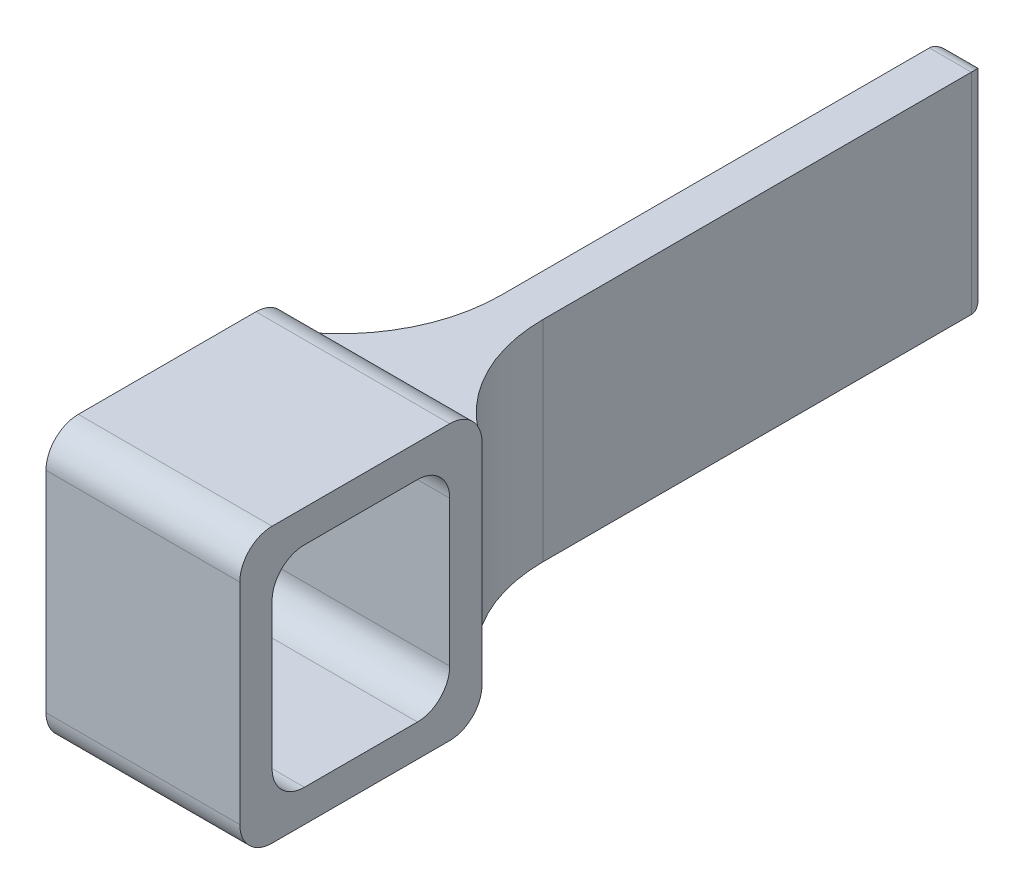
ISO-10303-21;
HEADER;
FILE_DESCRIPTION(('STEP AP214'),'2;1');
FILE_NAME('part.step','',(''),(''),'','','');
FILE_SCHEMA(('AUTOMOTIVE_DESIGN { 1 0 10303 214 1 1 1 1 }'));
ENDSEC;
DATA;
#1=APPLICATION_CONTEXT('core data for automotive mechanical design processes');
#2=APPLICATION_PROTOCOL_DEFINITION('international standard','automotive_design',2000,#1);
#3=PRODUCT_CONTEXT('',#1,'mechanical');
#4=PRODUCT('Part','Part','',(#3));
#5=PRODUCT_RELATED_PRODUCT_CATEGORY('part','',(#4));
#6=PRODUCT_DEFINITION_FORMATION('','',#4);
#7=PRODUCT_DEFINITION_CONTEXT('part definition',#1,'design');
#8=PRODUCT_DEFINITION('design','',#6,#7);
#9=PRODUCT_DEFINITION_SHAPE('','',#8);
#10=(LENGTH_UNIT() NAMED_UNIT(*) SI_UNIT(.MILLI.,.METRE.));
#11=(NAMED_UNIT(*) PLANE_ANGLE_UNIT() SI_UNIT($,.RADIAN.));
#12=(NAMED_UNIT(*) SI_UNIT($,.STERADIAN.) SOLID_ANGLE_UNIT());
#13=UNCERTAINTY_MEASURE_WITH_UNIT(LENGTH_MEASURE(1.E-05),#10,'distance_accuracy_value','');
#14=(GEOMETRIC_REPRESENTATION_CONTEXT(3) GLOBAL_UNCERTAINTY_ASSIGNED_CONTEXT((#13)) GLOBAL_UNIT_ASSIGNED_CONTEXT((#10,
#11,#12)) REPRESENTATION_CONTEXT('',''));
#15=CARTESIAN_POINT('',(0.,0.,0.));
#16=DIRECTION('',(0.,0.,1.));
#17=DIRECTION('',(1.,0.,0.));
#18=AXIS2_PLACEMENT_3D('',#15,#16,#17);
#19=CARTESIAN_POINT('',(-155.802837796785,45.9585336562613,-379.194639655427));
#20=DIRECTION('',(-1.,0.,0.));
#21=DIRECTION('',(0.,0.,1.));
#22=AXIS2_PLACEMENT_3D('',#19,#20,#21);
#23=CYLINDRICAL_SURFACE('',#22,0.999999999999973);
#24=CARTESIAN_POINT('',(-161.802837796785,45.9585336562613,-379.194639655427));
#25=DIRECTION('',(1.,0.,0.));
#26=DIRECTION('',(0.,0.,-1.));
#27=AXIS2_PLACEMENT_3D('',#24,#25,#26);
#28=CIRCLE('',#27,0.999999999999973);
#29=CARTESIAN_POINT('',(-161.802837796785,46.9585336562613,-379.194639655427));
#30=VERTEX_POINT('',#29);
#31=CARTESIAN_POINT('',(-161.802837796785,45.9585336562613,-378.194639655427));
#32=VERTEX_POINT('',#31);
#33=EDGE_CURVE('E254',#30,#32,#28,.T.);
#34=ORIENTED_EDGE('',*,*,#33,.T.);
#35=DIRECTION('',(-1.,0.,0.));
#36=VECTOR('',#35,1.);
#37=CARTESIAN_POINT('',(-155.802837796785,45.9585336562613,-378.194639655427));
#38=LINE('',#37,#36);
#39=CARTESIAN_POINT('',(-155.802837796785,45.9585336562613,-378.194639655427));
#40=VERTEX_POINT('',#39);
#41=EDGE_CURVE('E322',#40,#32,#38,.T.);
#42=ORIENTED_EDGE('',*,*,#41,.F.);
#43=CARTESIAN_POINT('',(-155.802837796785,45.9585336562613,-379.194639655427));
#44=DIRECTION('',(1.,0.,0.));
#45=DIRECTION('',(0.,0.,-1.));
#46=AXIS2_PLACEMENT_3D('',#43,#44,#45);
#47=CIRCLE('',#46,0.999999999999973);
#48=CARTESIAN_POINT('',(-155.802837796785,46.9585336562613,-379.194639655427));
#49=VERTEX_POINT('',#48);
#50=EDGE_CURVE('E266',#49,#40,#47,.T.);
#51=ORIENTED_EDGE('',*,*,#50,.F.);
#52=DIRECTION('',(-1.,0.,0.));
#53=VECTOR('',#52,1.);
#54=CARTESIAN_POINT('',(-155.802837796785,46.9585336562613,-379.194639655427));
#55=LINE('',#54,#53);
#56=EDGE_CURVE('E286',#49,#30,#55,.T.);
#57=ORIENTED_EDGE('',*,*,#56,.T.);
#58=EDGE_LOOP('',(#34,#42,#51,#57));
#59=FACE_BOUND('',#58,.T.);
#60=ADVANCED_FACE('F37',(#59),#23,.T.);
#61=CARTESIAN_POINT('',(-155.802837796785,45.9585336562613,-378.194639655427));
#62=DIRECTION('',(0.,0.,-1.));
#63=DIRECTION('',(-1.,0.,0.));
#64=AXIS2_PLACEMENT_3D('',#61,#62,#63);
#65=PLANE('',#64);
#66=DIRECTION('',(0.,-1.,0.));
#67=VECTOR('',#66,1.);
#68=CARTESIAN_POINT('',(-161.802837796785,45.9585336562613,-378.194639655427));
#69=LINE('',#68,#67);
#70=CARTESIAN_POINT('',(-161.802837796785,39.4585336562613,-378.194639655427));
#71=VERTEX_POINT('',#70);
#72=EDGE_CURVE('E289',#32,#71,#69,.T.);
#73=ORIENTED_EDGE('',*,*,#72,.T.);
#74=DIRECTION('',(-1.,0.,0.));
#75=VECTOR('',#74,1.);
#76=CARTESIAN_POINT('',(-155.802837796785,39.4585336562613,-378.194639655427));
#77=LINE('',#76,#75);
#78=CARTESIAN_POINT('',(-155.802837796785,39.4585336562613,-378.194639655427));
#79=VERTEX_POINT('',#78);
#80=EDGE_CURVE('E319',#79,#71,#77,.T.);
#81=ORIENTED_EDGE('',*,*,#80,.F.);
#82=DIRECTION('',(0.,-1.,0.));
#83=VECTOR('',#82,1.);
#84=CARTESIAN_POINT('',(-155.802837796785,45.9585336562613,-378.194639655427));
#85=LINE('',#84,#83);
#86=EDGE_CURVE('E269',#40,#79,#85,.T.);
#87=ORIENTED_EDGE('',*,*,#86,.F.);
#88=ORIENTED_EDGE('',*,*,#41,.T.);
#89=EDGE_LOOP('',(#73,#81,#87,#88));
#90=FACE_BOUND('',#89,.T.);
#91=ADVANCED_FACE('F399',(#90),#65,.F.);
#92=CARTESIAN_POINT('',(-155.802837796785,39.4585336562613,-379.194639655427));
#93=DIRECTION('',(-1.,0.,0.));
#94=DIRECTION('',(0.,0.,1.));
#95=AXIS2_PLACEMENT_3D('',#92,#93,#94);
#96=CYLINDRICAL_SURFACE('',#95,0.999999999999973);
#97=CARTESIAN_POINT('',(-161.802837796785,39.4585336562613,-379.194639655427));
#98=DIRECTION('',(1.,0.,0.));
#99=DIRECTION('',(0.,0.,1.));
#100=AXIS2_PLACEMENT_3D('',#97,#98,#99);
#101=CIRCLE('',#100,0.999999999999973);
#102=CARTESIAN_POINT('',(-161.802837796785,38.4585336562613,-379.194639655427));
#103=VERTEX_POINT('',#102);
#104=EDGE_CURVE('E291',#71,#103,#101,.T.);
#105=ORIENTED_EDGE('',*,*,#104,.T.);
#106=DIRECTION('',(-1.,0.,0.));
#107=VECTOR('',#106,1.);
#108=CARTESIAN_POINT('',(-155.802837796785,38.4585336562613,-379.194639655427));
#109=LINE('',#108,#107);
#110=CARTESIAN_POINT('',(-155.802837796785,38.4585336562613,-379.194639655427));
#111=VERTEX_POINT('',#110);
#112=EDGE_CURVE('E316',#111,#103,#109,.T.);
#113=ORIENTED_EDGE('',*,*,#112,.F.);
#114=CARTESIAN_POINT('',(-155.802837796785,39.4585336562613,-379.194639655427));
#115=DIRECTION('',(1.,0.,0.));
#116=DIRECTION('',(0.,0.,1.));
#117=AXIS2_PLACEMENT_3D('',#114,#115,#116);
#118=CIRCLE('',#117,0.999999999999973);
#119=EDGE_CURVE('E272',#79,#111,#118,.T.);
#120=ORIENTED_EDGE('',*,*,#119,.F.);
#121=ORIENTED_EDGE('',*,*,#80,.T.);
#122=EDGE_LOOP('',(#105,#113,#120,#121));
#123=FACE_BOUND('',#122,.T.);
#124=ADVANCED_FACE('F405',(#123),#96,.T.);
#125=CARTESIAN_POINT('',(-155.802837796785,38.4585336562613,-384.694639655427));
#126=DIRECTION('',(0.,1.,0.));
#127=DIRECTION('',(-1.,0.,0.));
#128=AXIS2_PLACEMENT_3D('',#125,#126,#127);
#129=PLANE('',#128);
#130=DIRECTION('',(0.,0.,-1.));
#131=VECTOR('',#130,1.);
#132=CARTESIAN_POINT('',(-161.802837796785,38.4585336562613,-384.694639655427));
#133=LINE('',#132,#131);
#134=CARTESIAN_POINT('',(-161.802837796785,38.4585336562613,-384.694639655427));
#135=VERTEX_POINT('',#134);
#136=EDGE_CURVE('E293',#103,#135,#133,.T.);
#137=ORIENTED_EDGE('',*,*,#136,.T.);
#138=DIRECTION('',(-1.,0.,0.));
#139=VECTOR('',#138,1.);
#140=CARTESIAN_POINT('',(-155.802837796785,38.4585336562613,-384.694639655427));
#141=LINE('',#140,#139);
#142=CARTESIAN_POINT('',(-155.802837796785,38.4585336562613,-384.694639655427));
#143=VERTEX_POINT('',#142);
#144=EDGE_CURVE('E313',#143,#135,#141,.T.);
#145=ORIENTED_EDGE('',*,*,#144,.F.);
#146=DIRECTION('',(0.,0.,-1.));
#147=VECTOR('',#146,1.);
#148=CARTESIAN_POINT('',(-155.802837796785,38.4585336562613,-384.694639655427));
#149=LINE('',#148,#147);
#150=EDGE_CURVE('E274',#111,#143,#149,.T.);
#151=ORIENTED_EDGE('',*,*,#150,.F.);
#152=ORIENTED_EDGE('',*,*,#112,.T.);
#153=EDGE_LOOP('',(#137,#145,#151,#152));
#154=FACE_BOUND('',#153,.T.);
#155=ADVANCED_FACE('F609',(#154),#129,.F.);
#156=CARTESIAN_POINT('',(-155.802837796785,39.4585336562613,-384.694639655427));
#157=DIRECTION('',(-1.,0.,0.));
#158=DIRECTION('',(0.,0.,1.));
#159=AXIS2_PLACEMENT_3D('',#156,#157,#158);
#160=CYLINDRICAL_SURFACE('',#159,0.999999999999973);
#161=CARTESIAN_POINT('',(-161.802837796785,39.4585336562613,-384.694639655427));
#162=DIRECTION('',(1.,0.,0.));
#163=DIRECTION('',(0.,0.,1.));
#164=AXIS2_PLACEMENT_3D('',#161,#162,#163);
#165=CIRCLE('',#164,0.999999999999973);
#166=CARTESIAN_POINT('',(-161.802837796785,39.4585336562613,-385.694639655427));
#167=VERTEX_POINT('',#166);
#168=EDGE_CURVE('E295',#135,#167,#165,.T.);
#169=ORIENTED_EDGE('',*,*,#168,.T.);
#170=DIRECTION('',(-1.,0.,0.));
#171=VECTOR('',#170,1.);
#172=CARTESIAN_POINT('',(-155.802837796785,39.4585336562613,-385.694639655427));
#173=LINE('',#172,#171);
#174=CARTESIAN_POINT('',(-155.802837796785,39.4585336562613,-385.694639655427));
#175=VERTEX_POINT('',#174);
#176=EDGE_CURVE('E311',#175,#167,#173,.T.);
#177=ORIENTED_EDGE('',*,*,#176,.F.);
#178=CARTESIAN_POINT('',(-155.802837796785,39.4585336562613,-384.694639655427));
#179=DIRECTION('',(1.,0.,0.));
#180=DIRECTION('',(0.,0.,1.));
#181=AXIS2_PLACEMENT_3D('',#178,#179,#180);
#182=CIRCLE('',#181,0.999999999999973);
#183=EDGE_CURVE('E276',#143,#175,#182,.T.);
#184=ORIENTED_EDGE('',*,*,#183,.F.);
#185=ORIENTED_EDGE('',*,*,#144,.T.);
#186=EDGE_LOOP('',(#169,#177,#184,#185));
#187=FACE_BOUND('',#186,.T.);
#188=ADVANCED_FACE('F442',(#187),#160,.T.);
#189=CARTESIAN_POINT('',(-155.802837796785,45.9585336562613,-384.694639655427));
#190=DIRECTION('',(-1.,0.,0.));
#191=DIRECTION('',(0.,0.,1.));
#192=AXIS2_PLACEMENT_3D('',#189,#190,#191);
#193=CYLINDRICAL_SURFACE('',#192,0.999999999999973);
#194=CARTESIAN_POINT('',(-161.802837796785,45.9585336562613,-384.694639655427));
#195=DIRECTION('',(1.,0.,0.));
#196=DIRECTION('',(0.,0.,1.));
#197=AXIS2_PLACEMENT_3D('',#194,#195,#196);
#198=CIRCLE('',#197,0.999999999999973);
#199=CARTESIAN_POINT('',(-161.802837796785,45.9585336562613,-385.694639655427));
#200=VERTEX_POINT('',#199);
#201=CARTESIAN_POINT('',(-161.802837796785,46.9585336562613,-384.694639655427));
#202=VERTEX_POINT('',#201);
#203=EDGE_CURVE('E301',#200,#202,#198,.T.);
#204=ORIENTED_EDGE('',*,*,#203,.T.);
#205=DIRECTION('',(-1.,0.,0.));
#206=VECTOR('',#205,1.);
#207=CARTESIAN_POINT('',(-155.802837796785,46.9585336562613,-384.694639655427));
#208=LINE('',#207,#206);
#209=CARTESIAN_POINT('',(-155.802837796785,46.9585336562613,-384.694639655427));
#210=VERTEX_POINT('',#209);
#211=EDGE_CURVE('E306',#210,#202,#208,.T.);
#212=ORIENTED_EDGE('',*,*,#211,.F.);
#213=CARTESIAN_POINT('',(-155.802837796785,45.9585336562613,-384.694639655427));
#214=DIRECTION('',(1.,0.,0.));
#215=DIRECTION('',(0.,0.,1.));
#216=AXIS2_PLACEMENT_3D('',#213,#214,#215);
#217=CIRCLE('',#216,0.999999999999973);
#218=CARTESIAN_POINT('',(-155.802837796785,45.9585336562613,-385.694639655427));
#219=VERTEX_POINT('',#218);
#220=EDGE_CURVE('E282',#219,#210,#217,.T.);
#221=ORIENTED_EDGE('',*,*,#220,.F.);
#222=DIRECTION('',(-1.,0.,0.));
#223=VECTOR('',#222,1.);
#224=CARTESIAN_POINT('',(-155.802837796785,45.9585336562613,-385.694639655427));
#225=LINE('',#224,#223);
#226=EDGE_CURVE('E309',#219,#200,#225,.T.);
#227=ORIENTED_EDGE('',*,*,#226,.T.);
#228=EDGE_LOOP('',(#204,#212,#221,#227));
#229=FACE_BOUND('',#228,.T.);
#230=ADVANCED_FACE('F449',(#229),#193,.T.);
#231=CARTESIAN_POINT('',(-155.802837796785,46.9585336562613,-384.694639655427));
#232=DIRECTION('',(0.,-1.,0.));
#233=DIRECTION('',(1.,0.,0.));
#234=AXIS2_PLACEMENT_3D('',#231,#232,#233);
#235=PLANE('',#234);
#236=DIRECTION('',(0.,0.,1.));
#237=VECTOR('',#236,1.);
#238=CARTESIAN_POINT('',(-161.802837796785,46.9585336562613,-384.694639655427));
#239=LINE('',#238,#237);
#240=EDGE_CURVE('E270',#202,#30,#239,.T.);
#241=ORIENTED_EDGE('',*,*,#240,.T.);
#242=ORIENTED_EDGE('',*,*,#56,.F.);
#243=DIRECTION('',(0.,0.,1.));
#244=VECTOR('',#243,1.);
#245=CARTESIAN_POINT('',(-155.802837796785,46.9585336562613,-384.694639655427));
#246=LINE('',#245,#244);
#247=EDGE_CURVE('E284',#210,#49,#246,.T.);
#248=ORIENTED_EDGE('',*,*,#247,.F.);
#249=ORIENTED_EDGE('',*,*,#211,.T.);
#250=EDGE_LOOP('',(#241,#242,#248,#249));
#251=FACE_BOUND('',#250,.T.);
#252=ADVANCED_FACE('F453',(#251),#235,.F.);
#253=CARTESIAN_POINT('',(-155.802837796785,45.9585336562613,-379.194639655427));
#254=DIRECTION('',(1.,0.,0.));
#255=DIRECTION('',(0.,0.,-1.));
#256=AXIS2_PLACEMENT_3D('',#253,#254,#255);
#257=PLANE('',#256);
#258=CARTESIAN_POINT('',(-155.802837796785,40.4585336562613,-383.694639655427));
#259=DIRECTION('',(1.,0.,0.));
#260=DIRECTION('',(0.,0.,-1.));
#261=AXIS2_PLACEMENT_3D('',#258,#259,#260);
#262=CIRCLE('',#261,0.99999999999997);
#263=CARTESIAN_POINT('',(-155.802837796785,39.4585336562613,-383.694639655427));
#264=VERTEX_POINT('',#263);
#265=CARTESIAN_POINT('',(-155.802837796785,40.4585336562613,-384.694639655427));
#266=VERTEX_POINT('',#265);
#267=EDGE_CURVE('E194',#264,#266,#262,.T.);
#268=ORIENTED_EDGE('',*,*,#267,.F.);
#269=DIRECTION('',(0.,0.,-1.));
#270=VECTOR('',#269,1.);
#271=CARTESIAN_POINT('',(-155.802837796785,39.4585336562613,-380.194639655427));
#272=LINE('',#271,#270);
#273=CARTESIAN_POINT('',(-155.802837796785,39.4585336562613,-380.194639655427));
#274=VERTEX_POINT('',#273);
#275=EDGE_CURVE('E213',#274,#264,#272,.T.);
#276=ORIENTED_EDGE('',*,*,#275,.F.);
#277=CARTESIAN_POINT('',(-155.802837796785,40.4585336562613,-380.194639655427));
#278=DIRECTION('',(1.,0.,0.));
#279=DIRECTION('',(0.,0.,-1.));
#280=AXIS2_PLACEMENT_3D('',#277,#278,#279);
#281=CIRCLE('',#280,0.99999999999997);
#282=CARTESIAN_POINT('',(-155.802837796785,40.4585336562613,-379.194639655427));
#283=VERTEX_POINT('',#282);
#284=EDGE_CURVE('E216',#283,#274,#281,.T.);
#285=ORIENTED_EDGE('',*,*,#284,.F.);
#286=DIRECTION('',(0.,-1.,0.));
#287=VECTOR('',#286,1.);
#288=CARTESIAN_POINT('',(-155.802837796785,44.9585336562613,-379.194639655427));
#289=LINE('',#288,#287);
#290=CARTESIAN_POINT('',(-155.802837796785,44.9585336562613,-379.194639655427));
#291=VERTEX_POINT('',#290);
#292=EDGE_CURVE('E247',#291,#283,#289,.T.);
#293=ORIENTED_EDGE('',*,*,#292,.F.);
#294=CARTESIAN_POINT('',(-155.802837796785,44.9585336562613,-380.194639655427));
#295=DIRECTION('',(1.,0.,0.));
#296=DIRECTION('',(0.,0.,-1.));
#297=AXIS2_PLACEMENT_3D('',#294,#295,#296);
#298=CIRCLE('',#297,0.99999999999997);
#299=CARTESIAN_POINT('',(-155.802837796785,45.9585336562612,-380.194639655427));
#300=VERTEX_POINT('',#299);
#301=EDGE_CURVE('E244',#300,#291,#298,.T.);
#302=ORIENTED_EDGE('',*,*,#301,.F.);
#303=DIRECTION('',(0.,0.,1.));
#304=VECTOR('',#303,1.);
#305=CARTESIAN_POINT('',(-155.802837796785,45.9585336562613,-380.194639655427));
#306=LINE('',#305,#304);
#307=CARTESIAN_POINT('',(-155.802837796785,45.9585336562613,-383.694639655427));
#308=VERTEX_POINT('',#307);
#309=EDGE_CURVE('E241',#308,#300,#306,.T.);
#310=ORIENTED_EDGE('',*,*,#309,.F.);
#311=CARTESIAN_POINT('',(-155.802837796785,44.9585336562613,-383.694639655427));
#312=DIRECTION('',(1.,0.,0.));
#313=DIRECTION('',(0.,0.,1.));
#314=AXIS2_PLACEMENT_3D('',#311,#312,#313);
#315=CIRCLE('',#314,0.99999999999997);
#316=CARTESIAN_POINT('',(-155.802837796785,44.9585336562613,-384.694639655427));
#317=VERTEX_POINT('',#316);
#318=EDGE_CURVE('E238',#317,#308,#315,.T.);
#319=ORIENTED_EDGE('',*,*,#318,.F.);
#320=DIRECTION('',(0.,1.,0.));
#321=VECTOR('',#320,1.);
#322=CARTESIAN_POINT('',(-155.802837796785,44.9585336562613,-384.694639655427));
#323=LINE('',#322,#321);
#324=EDGE_CURVE('E236',#266,#317,#323,.T.);
#325=ORIENTED_EDGE('',*,*,#324,.F.);
#326=EDGE_LOOP('',(#268,#276,#285,#293,#302,#310,#319,#325));
#327=FACE_BOUND('',#326,.T.);
#328=ORIENTED_EDGE('',*,*,#50,.T.);
#329=ORIENTED_EDGE('',*,*,#86,.T.);
#330=ORIENTED_EDGE('',*,*,#119,.T.);
#331=ORIENTED_EDGE('',*,*,#150,.T.);
#332=ORIENTED_EDGE('',*,*,#183,.T.);
#333=DIRECTION('',(0.,1.,0.));
#334=VECTOR('',#333,1.);
#335=CARTESIAN_POINT('',(-155.802837796785,45.9585336562613,-385.694639655427));
#336=LINE('',#335,#334);
#337=EDGE_CURVE('E279',#175,#219,#336,.T.);
#338=ORIENTED_EDGE('',*,*,#337,.T.);
#339=ORIENTED_EDGE('',*,*,#220,.T.);
#340=ORIENTED_EDGE('',*,*,#247,.T.);
#341=EDGE_LOOP('',(#328,#329,#330,#331,#332,#338,#339,#340));
#342=FACE_BOUND('',#341,.T.);
#343=ADVANCED_FACE('F457',(#327,#342),#257,.T.);
#344=CARTESIAN_POINT('',(-161.802837796785,45.9585336562613,-379.194639655427));
#345=DIRECTION('',(1.,0.,0.));
#346=DIRECTION('',(0.,0.,-1.));
#347=AXIS2_PLACEMENT_3D('',#344,#345,#346);
#348=PLANE('',#347);
#349=DIRECTION('',(0.,0.,-1.));
#350=VECTOR('',#349,1.);
#351=CARTESIAN_POINT('',(-161.802837796785,39.4585336562613,-380.194639655427));
#352=LINE('',#351,#350);
#353=CARTESIAN_POINT('',(-161.802837796785,39.4585336562613,-380.194639655427));
#354=VERTEX_POINT('',#353);
#355=CARTESIAN_POINT('',(-161.802837796785,39.4585336562613,-383.694639655427));
#356=VERTEX_POINT('',#355);
#357=EDGE_CURVE('E199',#354,#356,#352,.T.);
#358=ORIENTED_EDGE('',*,*,#357,.T.);
#359=CARTESIAN_POINT('',(-161.802837796785,40.4585336562613,-383.694639655427));
#360=DIRECTION('',(1.,0.,0.));
#361=DIRECTION('',(0.,0.,-1.));
#362=AXIS2_PLACEMENT_3D('',#359,#360,#361);
#363=CIRCLE('',#362,0.99999999999997);
#364=CARTESIAN_POINT('',(-161.802837796785,40.4585336562613,-384.694639655427));
#365=VERTEX_POINT('',#364);
#366=EDGE_CURVE('E191',#356,#365,#363,.T.);
#367=ORIENTED_EDGE('',*,*,#366,.T.);
#368=DIRECTION('',(0.,1.,0.));
#369=VECTOR('',#368,1.);
#370=CARTESIAN_POINT('',(-161.802837796785,44.9585336562613,-384.694639655427));
#371=LINE('',#370,#369);
#372=CARTESIAN_POINT('',(-161.802837796785,44.9585336562613,-384.694639655427));
#373=VERTEX_POINT('',#372);
#374=EDGE_CURVE('E203',#365,#373,#371,.T.);
#375=ORIENTED_EDGE('',*,*,#374,.T.);
#376=CARTESIAN_POINT('',(-161.802837796785,44.9585336562613,-383.694639655427));
#377=DIRECTION('',(1.,0.,0.));
#378=DIRECTION('',(0.,0.,1.));
#379=AXIS2_PLACEMENT_3D('',#376,#377,#378);
#380=CIRCLE('',#379,0.99999999999997);
#381=CARTESIAN_POINT('',(-161.802837796785,45.9585336562613,-383.694639655427));
#382=VERTEX_POINT('',#381);
#383=EDGE_CURVE('E207',#373,#382,#380,.T.);
#384=ORIENTED_EDGE('',*,*,#383,.T.);
#385=DIRECTION('',(0.,0.,1.));
#386=VECTOR('',#385,1.);
#387=CARTESIAN_POINT('',(-161.802837796785,45.9585336562613,-380.194639655427));
#388=LINE('',#387,#386);
#389=CARTESIAN_POINT('',(-161.802837796785,45.9585336562612,-380.194639655427));
#390=VERTEX_POINT('',#389);
#391=EDGE_CURVE('E223',#382,#390,#388,.T.);
#392=ORIENTED_EDGE('',*,*,#391,.T.);
#393=CARTESIAN_POINT('',(-161.802837796785,44.9585336562613,-380.194639655427));
#394=DIRECTION('',(1.,0.,0.));
#395=DIRECTION('',(0.,0.,-1.));
#396=AXIS2_PLACEMENT_3D('',#393,#394,#395);
#397=CIRCLE('',#396,0.99999999999997);
#398=CARTESIAN_POINT('',(-161.802837796785,44.9585336562613,-379.194639655427));
#399=VERTEX_POINT('',#398);
#400=EDGE_CURVE('E226',#390,#399,#397,.T.);
#401=ORIENTED_EDGE('',*,*,#400,.T.);
#402=DIRECTION('',(0.,-1.,0.));
#403=VECTOR('',#402,1.);
#404=CARTESIAN_POINT('',(-161.802837796785,44.9585336562613,-379.194639655427));
#405=LINE('',#404,#403);
#406=CARTESIAN_POINT('',(-161.802837796785,40.4585336562613,-379.194639655427));
#407=VERTEX_POINT('',#406);
#408=EDGE_CURVE('E229',#399,#407,#405,.T.);
#409=ORIENTED_EDGE('',*,*,#408,.T.);
#410=CARTESIAN_POINT('',(-161.802837796785,40.4585336562613,-380.194639655427));
#411=DIRECTION('',(1.,0.,0.));
#412=DIRECTION('',(0.,0.,-1.));
#413=AXIS2_PLACEMENT_3D('',#410,#411,#412);
#414=CIRCLE('',#413,0.99999999999997);
#415=EDGE_CURVE('E232',#407,#354,#414,.T.);
#416=ORIENTED_EDGE('',*,*,#415,.T.);
#417=EDGE_LOOP('',(#358,#367,#375,#384,#392,#401,#409,#416));
#418=FACE_BOUND('',#417,.T.);
#419=ORIENTED_EDGE('',*,*,#33,.F.);
#420=ORIENTED_EDGE('',*,*,#240,.F.);
#421=ORIENTED_EDGE('',*,*,#203,.F.);
#422=DIRECTION('',(0.,1.,0.));
#423=VECTOR('',#422,1.);
#424=CARTESIAN_POINT('',(-161.802837796785,45.9585336562613,-385.694639655427));
#425=LINE('',#424,#423);
#426=EDGE_CURVE('E298',#167,#200,#425,.T.);
#427=ORIENTED_EDGE('',*,*,#426,.F.);
#428=ORIENTED_EDGE('',*,*,#168,.F.);
#429=ORIENTED_EDGE('',*,*,#136,.F.);
#430=ORIENTED_EDGE('',*,*,#104,.F.);
#431=ORIENTED_EDGE('',*,*,#72,.F.);
#432=EDGE_LOOP('',(#419,#420,#421,#427,#428,#429,#430,#431));
#433=FACE_BOUND('',#432,.T.);
#434=ADVANCED_FACE('F209',(#418,#433),#348,.F.);
#435=CARTESIAN_POINT('',(-161.802837796785,40.4585336562613,-383.694639655427));
#436=DIRECTION('',(1.,0.,0.));
#437=DIRECTION('',(0.,0.,-1.));
#438=AXIS2_PLACEMENT_3D('',#435,#436,#437);
#439=CYLINDRICAL_SURFACE('',#438,0.99999999999997);
#440=ORIENTED_EDGE('',*,*,#267,.T.);
#441=DIRECTION('',(1.,0.,0.));
#442=VECTOR('',#441,1.);
#443=CARTESIAN_POINT('',(-161.802837796785,40.4585336562613,-384.694639655427));
#444=LINE('',#443,#442);
#445=EDGE_CURVE('E187',#365,#266,#444,.T.);
#446=ORIENTED_EDGE('',*,*,#445,.F.);
#447=ORIENTED_EDGE('',*,*,#366,.F.);
#448=DIRECTION('',(1.,0.,0.));
#449=VECTOR('',#448,1.);
#450=CARTESIAN_POINT('',(-161.802837796785,39.4585336562613,-383.694639655427));
#451=LINE('',#450,#449);
#452=EDGE_CURVE('E252',#356,#264,#451,.T.);
#453=ORIENTED_EDGE('',*,*,#452,.T.);
#454=EDGE_LOOP('',(#440,#446,#447,#453));
#455=FACE_BOUND('',#454,.T.);
#456=ADVANCED_FACE('F189',(#455),#439,.F.);
#457=CARTESIAN_POINT('',(-161.802837796785,39.4585336562613,-380.194639655427));
#458=DIRECTION('',(0.,-1.,0.));
#459=DIRECTION('',(1.,0.,0.));
#460=AXIS2_PLACEMENT_3D('',#457,#458,#459);
#461=PLANE('',#460);
#462=ORIENTED_EDGE('',*,*,#275,.T.);
#463=ORIENTED_EDGE('',*,*,#452,.F.);
#464=ORIENTED_EDGE('',*,*,#357,.F.);
#465=DIRECTION('',(1.,0.,0.));
#466=VECTOR('',#465,1.);
#467=CARTESIAN_POINT('',(-161.802837796785,39.4585336562613,-380.194639655427));
#468=LINE('',#467,#466);
#469=EDGE_CURVE('E255',#354,#274,#468,.T.);
#470=ORIENTED_EDGE('',*,*,#469,.T.);
#471=EDGE_LOOP('',(#462,#463,#464,#470));
#472=FACE_BOUND('',#471,.T.);
#473=ADVANCED_FACE('F558',(#472),#461,.F.);
#474=CARTESIAN_POINT('',(-161.802837796785,40.4585336562613,-380.194639655427));
#475=DIRECTION('',(1.,0.,0.));
#476=DIRECTION('',(0.,0.,-1.));
#477=AXIS2_PLACEMENT_3D('',#474,#475,#476);
#478=CYLINDRICAL_SURFACE('',#477,0.99999999999997);
#479=ORIENTED_EDGE('',*,*,#284,.T.);
#480=ORIENTED_EDGE('',*,*,#469,.F.);
#481=ORIENTED_EDGE('',*,*,#415,.F.);
#482=DIRECTION('',(1.,0.,0.));
#483=VECTOR('',#482,1.);
#484=CARTESIAN_POINT('',(-161.802837796785,40.4585336562613,-379.194639655427));
#485=LINE('',#484,#483);
#486=EDGE_CURVE('E257',#407,#283,#485,.T.);
#487=ORIENTED_EDGE('',*,*,#486,.T.);
#488=EDGE_LOOP('',(#479,#480,#481,#487));
#489=FACE_BOUND('',#488,.T.);
#490=ADVANCED_FACE('F549',(#489),#478,.F.);
#491=CARTESIAN_POINT('',(-161.802837796785,44.9585336562613,-379.194639655427));
#492=DIRECTION('',(0.,0.,1.));
#493=DIRECTION('',(1.,0.,0.));
#494=AXIS2_PLACEMENT_3D('',#491,#492,#493);
#495=PLANE('',#494);
#496=ORIENTED_EDGE('',*,*,#292,.T.);
#497=ORIENTED_EDGE('',*,*,#486,.F.);
#498=ORIENTED_EDGE('',*,*,#408,.F.);
#499=DIRECTION('',(1.,0.,0.));
#500=VECTOR('',#499,1.);
#501=CARTESIAN_POINT('',(-161.802837796785,44.9585336562613,-379.194639655427));
#502=LINE('',#501,#500);
#503=EDGE_CURVE('E259',#399,#291,#502,.T.);
#504=ORIENTED_EDGE('',*,*,#503,.T.);
#505=EDGE_LOOP('',(#496,#497,#498,#504));
#506=FACE_BOUND('',#505,.T.);
#507=ADVANCED_FACE('F540',(#506),#495,.F.);
#508=CARTESIAN_POINT('',(-161.802837796785,44.9585336562613,-380.194639655427));
#509=DIRECTION('',(1.,0.,0.));
#510=DIRECTION('',(0.,0.,-1.));
#511=AXIS2_PLACEMENT_3D('',#508,#509,#510);
#512=CYLINDRICAL_SURFACE('',#511,0.99999999999997);
#513=ORIENTED_EDGE('',*,*,#301,.T.);
#514=ORIENTED_EDGE('',*,*,#503,.F.);
#515=ORIENTED_EDGE('',*,*,#400,.F.);
#516=DIRECTION('',(1.,0.,0.));
#517=VECTOR('',#516,1.);
#518=CARTESIAN_POINT('',(-161.802837796785,45.9585336562612,-380.194639655427));
#519=LINE('',#518,#517);
#520=EDGE_CURVE('E261',#390,#300,#519,.T.);
#521=ORIENTED_EDGE('',*,*,#520,.T.);
#522=EDGE_LOOP('',(#513,#514,#515,#521));
#523=FACE_BOUND('',#522,.T.);
#524=ADVANCED_FACE('F531',(#523),#512,.F.);
#525=CARTESIAN_POINT('',(-161.802837796785,45.9585336562613,-380.194639655427));
#526=DIRECTION('',(0.,1.,0.));
#527=DIRECTION('',(-1.,0.,0.));
#528=AXIS2_PLACEMENT_3D('',#525,#526,#527);
#529=PLANE('',#528);
#530=ORIENTED_EDGE('',*,*,#309,.T.);
#531=ORIENTED_EDGE('',*,*,#520,.F.);
#532=ORIENTED_EDGE('',*,*,#391,.F.);
#533=DIRECTION('',(1.,0.,0.));
#534=VECTOR('',#533,1.);
#535=CARTESIAN_POINT('',(-161.802837796785,45.9585336562613,-383.694639655427));
#536=LINE('',#535,#534);
#537=EDGE_CURVE('E263',#382,#308,#536,.T.);
#538=ORIENTED_EDGE('',*,*,#537,.T.);
#539=EDGE_LOOP('',(#530,#531,#532,#538));
#540=FACE_BOUND('',#539,.T.);
#541=ADVANCED_FACE('F522',(#540),#529,.F.);
#542=CARTESIAN_POINT('',(-161.802837796785,44.9585336562613,-383.694639655427));
#543=DIRECTION('',(1.,0.,0.));
#544=DIRECTION('',(0.,0.,-1.));
#545=AXIS2_PLACEMENT_3D('',#542,#543,#544);
#546=CYLINDRICAL_SURFACE('',#545,0.99999999999997);
#547=ORIENTED_EDGE('',*,*,#318,.T.);
#548=ORIENTED_EDGE('',*,*,#537,.F.);
#549=ORIENTED_EDGE('',*,*,#383,.F.);
#550=DIRECTION('',(1.,0.,0.));
#551=VECTOR('',#550,1.);
#552=CARTESIAN_POINT('',(-161.802837796785,44.9585336562613,-384.694639655427));
#553=LINE('',#552,#551);
#554=EDGE_CURVE('E198',#373,#317,#553,.T.);
#555=ORIENTED_EDGE('',*,*,#554,.T.);
#556=EDGE_LOOP('',(#547,#548,#549,#555));
#557=FACE_BOUND('',#556,.T.);
#558=ADVANCED_FACE('F395',(#557),#546,.F.);
#559=CARTESIAN_POINT('',(-161.802837796785,44.9585336562613,-384.694639655427));
#560=DIRECTION('',(0.,0.,-1.));
#561=DIRECTION('',(-1.,0.,0.));
#562=AXIS2_PLACEMENT_3D('',#559,#560,#561);
#563=PLANE('',#562);
#564=ORIENTED_EDGE('',*,*,#324,.T.);
#565=ORIENTED_EDGE('',*,*,#554,.F.);
#566=ORIENTED_EDGE('',*,*,#374,.F.);
#567=ORIENTED_EDGE('',*,*,#445,.T.);
#568=EDGE_LOOP('',(#564,#565,#566,#567));
#569=FACE_BOUND('',#568,.T.);
#570=ADVANCED_FACE('F204',(#569),#563,.F.);
#571=CARTESIAN_POINT('',(-159.452837796785,45.9585336562612,-403.694639655427));
#572=DIRECTION('',(1.,0.,0.));
#573=DIRECTION('',(0.,0.,-1.));
#574=AXIS2_PLACEMENT_3D('',#571,#572,#573);
#575=PLANE('',#574);
#576=DIRECTION('',(0.,0.,1.));
#577=VECTOR('',#576,1.);
#578=CARTESIAN_POINT('',(-159.452837796785,45.9585336562612,-403.694639655427));
#579=LINE('',#578,#577);
#580=CARTESIAN_POINT('',(-159.452837796785,45.9585336562612,-403.194639655427));
#581=VERTEX_POINT('',#580);
#582=CARTESIAN_POINT('',(-159.452837796785,45.9585336562612,-389.934627862958));
#583=VERTEX_POINT('',#582);
#584=EDGE_CURVE('E219',#581,#583,#579,.T.);
#585=ORIENTED_EDGE('',*,*,#584,.F.);
#586=DIRECTION('',(0.,1.,0.));
#587=VECTOR('',#586,1.);
#588=CARTESIAN_POINT('',(-159.452837796785,45.9585336562612,-403.194639655427));
#589=LINE('',#588,#587);
#590=CARTESIAN_POINT('',(-159.452837796785,39.4585336562613,-403.194639655427));
#591=VERTEX_POINT('',#590);
#592=EDGE_CURVE('E351',#581,#591,#589,.F.);
#593=ORIENTED_EDGE('',*,*,#592,.T.);
#594=DIRECTION('',(0.,0.,1.));
#595=VECTOR('',#594,1.);
#596=CARTESIAN_POINT('',(-159.452837796785,39.4585336562613,-403.694639655427));
#597=LINE('',#596,#595);
#598=CARTESIAN_POINT('',(-159.452837796785,39.4585336562613,-389.934627862958));
#599=VERTEX_POINT('',#598);
#600=EDGE_CURVE('E366',#591,#599,#597,.T.);
#601=ORIENTED_EDGE('',*,*,#600,.T.);
#602=DIRECTION('',(0.,1.,0.));
#603=VECTOR('',#602,1.);
#604=CARTESIAN_POINT('',(-159.452837796785,45.9585336562612,-389.934627862958));
#605=LINE('',#604,#603);
#606=EDGE_CURVE('E325',#599,#583,#605,.T.);
#607=ORIENTED_EDGE('',*,*,#606,.T.);
#608=EDGE_LOOP('',(#585,#593,#601,#607));
#609=FACE_BOUND('',#608,.T.);
#610=ADVANCED_FACE('F386',(#609),#575,.F.);
#611=CARTESIAN_POINT('',(-159.452837796785,45.9585336562612,-403.694639655427));
#612=DIRECTION('',(0.,-1.,0.));
#613=DIRECTION('',(1.,0.,0.));
#614=AXIS2_PLACEMENT_3D('',#611,#612,#613);
#615=PLANE('',#614);
#616=DIRECTION('',(0.,0.,1.));
#617=VECTOR('',#616,1.);
#618=CARTESIAN_POINT('',(-158.152837796785,45.9585336562612,-403.694639655427));
#619=LINE('',#618,#617);
#620=CARTESIAN_POINT('',(-158.152837796785,45.9585336562612,-403.194639655427));
#621=VERTEX_POINT('',#620);
#622=CARTESIAN_POINT('',(-158.152837796785,45.9585336562612,-389.934627862958));
#623=VERTEX_POINT('',#622);
#624=EDGE_CURVE('E373',#621,#623,#619,.T.);
#625=ORIENTED_EDGE('',*,*,#624,.F.);
#626=DIRECTION('',(1.,0.,0.));
#627=VECTOR('',#626,1.);
#628=CARTESIAN_POINT('',(-159.452837796785,45.9585336562612,-403.194639655427));
#629=LINE('',#628,#627);
#630=EDGE_CURVE('E11',#621,#581,#629,.F.);
#631=ORIENTED_EDGE('',*,*,#630,.T.);
#632=ORIENTED_EDGE('',*,*,#584,.T.);
#633=CARTESIAN_POINT('',(-164.452837796785,45.9585336562613,-389.934627862958));
#634=DIRECTION('',(0.,-1.,0.));
#635=DIRECTION('',(1.,0.,0.));
#636=AXIS2_PLACEMENT_3D('',#633,#634,#635);
#637=CIRCLE('',#636,5.);
#638=EDGE_CURVE('E331',#583,#200,#637,.T.);
#639=ORIENTED_EDGE('',*,*,#638,.T.);
#640=ORIENTED_EDGE('',*,*,#226,.F.);
#641=CARTESIAN_POINT('',(-153.152837796785,45.9585336562612,-389.934627862958));
#642=DIRECTION('',(0.,-1.,0.));
#643=DIRECTION('',(1.,0.,0.));
#644=AXIS2_PLACEMENT_3D('',#641,#642,#643);
#645=CIRCLE('',#644,5.);
#646=EDGE_CURVE('E339',#219,#623,#645,.T.);
#647=ORIENTED_EDGE('',*,*,#646,.T.);
#648=EDGE_LOOP('',(#625,#631,#632,#639,#640,#647));
#649=FACE_BOUND('',#648,.T.);
#650=ADVANCED_FACE('F378',(#649),#615,.F.);
#651=CARTESIAN_POINT('',(-158.152837796785,45.9585336562612,-403.694639655427));
#652=DIRECTION('',(-1.,0.,0.));
#653=DIRECTION('',(0.,0.,1.));
#654=AXIS2_PLACEMENT_3D('',#651,#652,#653);
#655=PLANE('',#654);
#656=DIRECTION('',(0.,0.,1.));
#657=VECTOR('',#656,1.);
#658=CARTESIAN_POINT('',(-158.152837796785,39.4585336562613,-403.694639655427));
#659=LINE('',#658,#657);
#660=CARTESIAN_POINT('',(-158.152837796785,39.4585336562613,-403.194639655427));
#661=VERTEX_POINT('',#660);
#662=CARTESIAN_POINT('',(-158.152837796785,39.4585336562613,-389.934627862958));
#663=VERTEX_POINT('',#662);
#664=EDGE_CURVE('E370',#661,#663,#659,.T.);
#665=ORIENTED_EDGE('',*,*,#664,.F.);
#666=DIRECTION('',(0.,-1.,0.));
#667=VECTOR('',#666,1.);
#668=CARTESIAN_POINT('',(-158.152837796785,45.9585336562612,-403.194639655427));
#669=LINE('',#668,#667);
#670=EDGE_CURVE('E60',#661,#621,#669,.F.);
#671=ORIENTED_EDGE('',*,*,#670,.T.);
#672=ORIENTED_EDGE('',*,*,#624,.T.);
#673=DIRECTION('',(0.,1.,0.));
#674=VECTOR('',#673,1.);
#675=CARTESIAN_POINT('',(-158.152837796785,45.9585336562612,-389.934627862958));
#676=LINE('',#675,#674);
#677=EDGE_CURVE('E328',#623,#663,#676,.F.);
#678=ORIENTED_EDGE('',*,*,#677,.T.);
#679=EDGE_LOOP('',(#665,#671,#672,#678));
#680=FACE_BOUND('',#679,.T.);
#681=ADVANCED_FACE('F393',(#680),#655,.F.);
#682=CARTESIAN_POINT('',(-159.452837796785,39.4585336562613,-403.694639655427));
#683=DIRECTION('',(0.,1.,0.));
#684=DIRECTION('',(0.,0.,1.));
#685=AXIS2_PLACEMENT_3D('',#682,#683,#684);
#686=PLANE('',#685);
#687=ORIENTED_EDGE('',*,*,#600,.F.);
#688=DIRECTION('',(-1.,0.,0.));
#689=VECTOR('',#688,1.);
#690=CARTESIAN_POINT('',(-159.452837796785,39.4585336562613,-403.194639655427));
#691=LINE('',#690,#689);
#692=EDGE_CURVE('E46',#591,#661,#691,.F.);
#693=ORIENTED_EDGE('',*,*,#692,.T.);
#694=ORIENTED_EDGE('',*,*,#664,.T.);
#695=CARTESIAN_POINT('',(-153.152837796785,39.4585336562613,-389.934627862958));
#696=DIRECTION('',(0.,1.,0.));
#697=DIRECTION('',(0.,0.,1.));
#698=AXIS2_PLACEMENT_3D('',#695,#696,#697);
#699=CIRCLE('',#698,5.);
#700=EDGE_CURVE('E337',#663,#175,#699,.T.);
#701=ORIENTED_EDGE('',*,*,#700,.T.);
#702=ORIENTED_EDGE('',*,*,#176,.T.);
#703=CARTESIAN_POINT('',(-164.452837796785,39.4585336562613,-389.934627862958));
#704=DIRECTION('',(0.,1.,0.));
#705=DIRECTION('',(0.,0.,1.));
#706=AXIS2_PLACEMENT_3D('',#703,#704,#705);
#707=CIRCLE('',#706,5.);
#708=EDGE_CURVE('E334',#167,#599,#707,.T.);
#709=ORIENTED_EDGE('',*,*,#708,.T.);
#710=EDGE_LOOP('',(#687,#693,#694,#701,#702,#709));
#711=FACE_BOUND('',#710,.T.);
#712=ADVANCED_FACE('F435',(#711),#686,.F.);
#713=CARTESIAN_POINT('',(0.,0.,-403.694639655427));
#714=DIRECTION('',(0.,0.,1.));
#715=DIRECTION('',(1.,0.,0.));
#716=AXIS2_PLACEMENT_3D('',#713,#714,#715);
#717=PLANE('',#716);
#718=DIRECTION('',(0.,-1.,0.));
#719=VECTOR('',#718,1.);
#720=CARTESIAN_POINT('',(-158.652837796785,0.,-403.694639655427));
#721=LINE('',#720,#719);
#722=CARTESIAN_POINT('',(-158.652837796785,45.4585336562612,-403.694639655427));
#723=VERTEX_POINT('',#722);
#724=CARTESIAN_POINT('',(-158.652837796785,39.9585336562613,-403.694639655427));
#725=VERTEX_POINT('',#724);
#726=EDGE_CURVE('E344',#723,#725,#721,.T.);
#727=ORIENTED_EDGE('',*,*,#726,.T.);
#728=DIRECTION('',(-1.,0.,0.));
#729=VECTOR('',#728,1.);
#730=CARTESIAN_POINT('',(0.,39.9585336562613,-403.694639655427));
#731=LINE('',#730,#729);
#732=CARTESIAN_POINT('',(-158.952837796785,39.9585336562613,-403.694639655427));
#733=VERTEX_POINT('',#732);
#734=EDGE_CURVE('E349',#725,#733,#731,.T.);
#735=ORIENTED_EDGE('',*,*,#734,.T.);
#736=DIRECTION('',(0.,1.,0.));
#737=VECTOR('',#736,1.);
#738=CARTESIAN_POINT('',(-158.952837796785,0.,-403.694639655427));
#739=LINE('',#738,#737);
#740=CARTESIAN_POINT('',(-158.952837796785,45.4585336562612,-403.694639655427));
#741=VERTEX_POINT('',#740);
#742=EDGE_CURVE('E346',#733,#741,#739,.T.);
#743=ORIENTED_EDGE('',*,*,#742,.T.);
#744=DIRECTION('',(1.,0.,0.));
#745=VECTOR('',#744,1.);
#746=CARTESIAN_POINT('',(2.46636758325559E-13,45.4585336562604,-403.694639655427));
#747=LINE('',#746,#745);
#748=EDGE_CURVE('E342',#741,#723,#747,.T.);
#749=ORIENTED_EDGE('',*,*,#748,.T.);
#750=EDGE_LOOP('',(#727,#735,#743,#749));
#751=FACE_BOUND('',#750,.T.);
#752=ADVANCED_FACE('F413',(#751),#717,.F.);
#753=CARTESIAN_POINT('',(-164.452837796785,45.9585336562613,-389.934627862958));
#754=DIRECTION('',(0.,1.,0.));
#755=DIRECTION('',(-1.,0.,0.));
#756=AXIS2_PLACEMENT_3D('',#753,#754,#755);
#757=CYLINDRICAL_SURFACE('',#756,5.);
#758=ORIENTED_EDGE('',*,*,#708,.F.);
#759=ORIENTED_EDGE('',*,*,#426,.T.);
#760=ORIENTED_EDGE('',*,*,#638,.F.);
#761=ORIENTED_EDGE('',*,*,#606,.F.);
#762=EDGE_LOOP('',(#758,#759,#760,#761));
#763=FACE_BOUND('',#762,.T.);
#764=ADVANCED_FACE('F384',(#763),#757,.F.);
#765=CARTESIAN_POINT('',(-153.152837796785,45.9585336562613,-389.934627862958));
#766=DIRECTION('',(0.,1.,0.));
#767=DIRECTION('',(-1.,0.,0.));
#768=AXIS2_PLACEMENT_3D('',#765,#766,#767);
#769=CYLINDRICAL_SURFACE('',#768,5.);
#770=ORIENTED_EDGE('',*,*,#646,.F.);
#771=ORIENTED_EDGE('',*,*,#337,.F.);
#772=ORIENTED_EDGE('',*,*,#700,.F.);
#773=ORIENTED_EDGE('',*,*,#677,.F.);
#774=EDGE_LOOP('',(#770,#771,#772,#773));
#775=FACE_BOUND('',#774,.T.);
#776=ADVANCED_FACE('F412',(#775),#769,.F.);
#777=CARTESIAN_POINT('',(-158.652837796785,0.,-403.194639655427));
#778=DIRECTION('',(0.,-1.,0.));
#779=DIRECTION('',(0.,0.,-1.));
#780=AXIS2_PLACEMENT_3D('',#777,#778,#779);
#781=CYLINDRICAL_SURFACE('',#780,0.5);
#782=CARTESIAN_POINT('',(-158.652837796785,45.4585336562612,-403.194639655427));
#783=DIRECTION('',(0.707106781186546,-0.707106781186549,0.));
#784=DIRECTION('',(0.707106781186549,0.707106781186546,0.));
#785=AXIS2_PLACEMENT_3D('',#782,#783,#784);
#786=ELLIPSE('',#785,0.707106781186546,0.5);
#787=EDGE_CURVE('E359',#621,#723,#786,.F.);
#788=ORIENTED_EDGE('',*,*,#787,.F.);
#789=ORIENTED_EDGE('',*,*,#670,.F.);
#790=CARTESIAN_POINT('',(-158.652837796785,39.9585336562613,-403.194639655427));
#791=DIRECTION('',(-0.707106781186547,-0.707106781186547,0.));
#792=DIRECTION('',(-0.707106781186547,0.707106781186547,0.));
#793=AXIS2_PLACEMENT_3D('',#790,#791,#792);
#794=ELLIPSE('',#793,0.707106781186547,0.5);
#795=EDGE_CURVE('E41',#725,#661,#794,.T.);
#796=ORIENTED_EDGE('',*,*,#795,.F.);
#797=ORIENTED_EDGE('',*,*,#726,.F.);
#798=EDGE_LOOP('',(#788,#789,#796,#797));
#799=FACE_BOUND('',#798,.T.);
#800=ADVANCED_FACE('F39',(#799),#781,.T.);
#801=CARTESIAN_POINT('',(0.,39.9585336562613,-403.194639655427));
#802=DIRECTION('',(-1.,0.,0.));
#803=DIRECTION('',(0.,0.,1.));
#804=AXIS2_PLACEMENT_3D('',#801,#802,#803);
#805=CYLINDRICAL_SURFACE('',#804,0.5);
#806=ORIENTED_EDGE('',*,*,#795,.T.);
#807=ORIENTED_EDGE('',*,*,#692,.F.);
#808=CARTESIAN_POINT('',(-158.952837796785,39.9585336562613,-403.194639655427));
#809=DIRECTION('',(-0.707106781186547,0.707106781186547,0.));
#810=DIRECTION('',(-0.707106781186547,-0.707106781186547,0.));
#811=AXIS2_PLACEMENT_3D('',#808,#809,#810);
#812=ELLIPSE('',#811,0.707106781186547,0.5);
#813=EDGE_CURVE('E358',#733,#591,#812,.T.);
#814=ORIENTED_EDGE('',*,*,#813,.F.);
#815=ORIENTED_EDGE('',*,*,#734,.F.);
#816=EDGE_LOOP('',(#806,#807,#814,#815));
#817=FACE_BOUND('',#816,.T.);
#818=ADVANCED_FACE('F423',(#817),#805,.T.);
#819=CARTESIAN_POINT('',(2.46636758325559E-13,45.4585336562604,-403.194639655427));
#820=DIRECTION('',(1.,0.,0.));
#821=DIRECTION('',(0.,1.,0.));
#822=AXIS2_PLACEMENT_3D('',#819,#820,#821);
#823=CYLINDRICAL_SURFACE('',#822,0.5);
#824=ORIENTED_EDGE('',*,*,#787,.T.);
#825=ORIENTED_EDGE('',*,*,#748,.F.);
#826=CARTESIAN_POINT('',(-158.952837796785,45.4585336562612,-403.194639655427));
#827=DIRECTION('',(0.707106781186549,0.707106781186546,0.));
#828=DIRECTION('',(0.707106781186546,-0.707106781186549,0.));
#829=AXIS2_PLACEMENT_3D('',#826,#827,#828);
#830=ELLIPSE('',#829,0.707106781186549,0.5);
#831=EDGE_CURVE('E356',#581,#741,#830,.F.);
#832=ORIENTED_EDGE('',*,*,#831,.F.);
#833=ORIENTED_EDGE('',*,*,#630,.F.);
#834=EDGE_LOOP('',(#824,#825,#832,#833));
#835=FACE_BOUND('',#834,.T.);
#836=ADVANCED_FACE('F420',(#835),#823,.T.);
#837=CARTESIAN_POINT('',(-158.952837796785,0.,-403.194639655427));
#838=DIRECTION('',(0.,1.,0.));
#839=DIRECTION('',(0.,0.,1.));
#840=AXIS2_PLACEMENT_3D('',#837,#838,#839);
#841=CYLINDRICAL_SURFACE('',#840,0.5);
#842=ORIENTED_EDGE('',*,*,#813,.T.);
#843=ORIENTED_EDGE('',*,*,#592,.F.);
#844=ORIENTED_EDGE('',*,*,#831,.T.);
#845=ORIENTED_EDGE('',*,*,#742,.F.);
#846=EDGE_LOOP('',(#842,#843,#844,#845));
#847=FACE_BOUND('',#846,.T.);
#848=ADVANCED_FACE('F417',(#847),#841,.T.);
#849=CLOSED_SHELL('',(#60,#91,#124,#155,#188,#230,#252,#343,#434,#456,#473,#490,#507,#524,#541,
#558,#570,#610,#650,#681,#712,#752,#764,#776,#800,#818,#836,#848));
#850=MANIFOLD_SOLID_BREP('B2',#849);
#851=ADVANCED_BREP_SHAPE_REPRESENTATION('',(#18,#850),#14);
#852=SHAPE_DEFINITION_REPRESENTATION(#9,#851);
ENDSEC;
END-ISO-10303-21;
